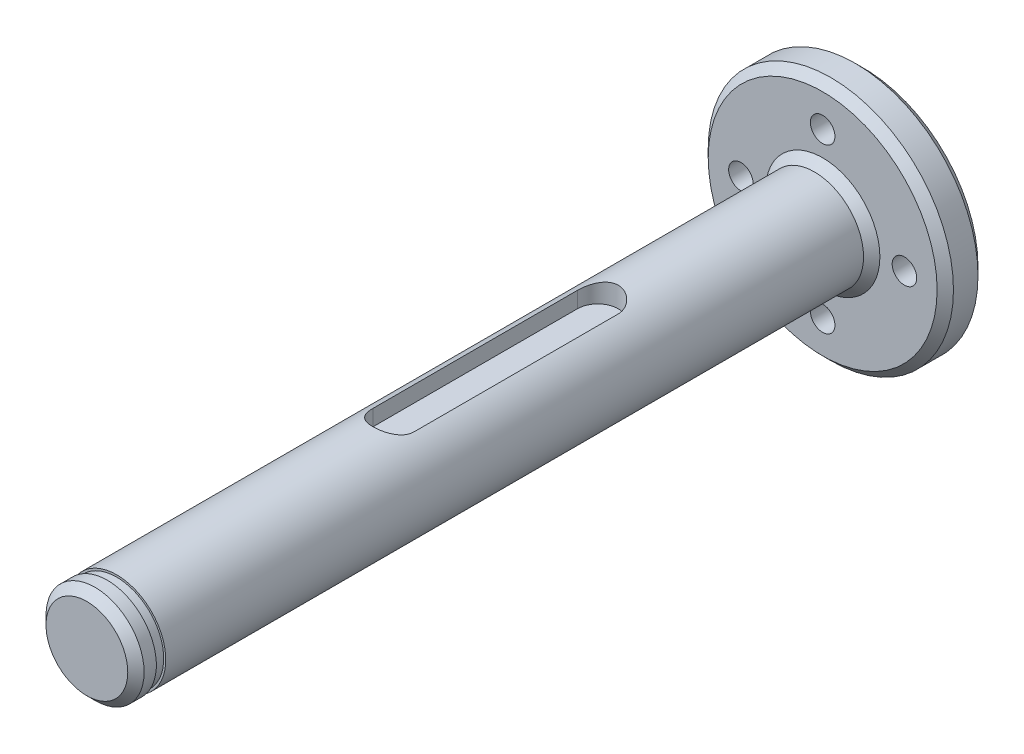
ISO-10303-21;
HEADER;
FILE_DESCRIPTION(('STEP AP214'),'2;1');
FILE_NAME('part.step','',(''),(''),'','','');
FILE_SCHEMA(('AUTOMOTIVE_DESIGN { 1 0 10303 214 1 1 1 1 }'));
ENDSEC;
DATA;
#1=APPLICATION_CONTEXT('core data for automotive mechanical design processes');
#2=APPLICATION_PROTOCOL_DEFINITION('international standard','automotive_design',2000,#1);
#3=PRODUCT_CONTEXT('',#1,'mechanical');
#4=PRODUCT('Part','Part','',(#3));
#5=PRODUCT_RELATED_PRODUCT_CATEGORY('part','',(#4));
#6=PRODUCT_DEFINITION_FORMATION('','',#4);
#7=PRODUCT_DEFINITION_CONTEXT('part definition',#1,'design');
#8=PRODUCT_DEFINITION('design','',#6,#7);
#9=PRODUCT_DEFINITION_SHAPE('','',#8);
#10=(LENGTH_UNIT() NAMED_UNIT(*) SI_UNIT(.MILLI.,.METRE.));
#11=(NAMED_UNIT(*) PLANE_ANGLE_UNIT() SI_UNIT($,.RADIAN.));
#12=(NAMED_UNIT(*) SI_UNIT($,.STERADIAN.) SOLID_ANGLE_UNIT());
#13=UNCERTAINTY_MEASURE_WITH_UNIT(LENGTH_MEASURE(1.E-05),#10,'distance_accuracy_value','');
#14=(GEOMETRIC_REPRESENTATION_CONTEXT(3) GLOBAL_UNCERTAINTY_ASSIGNED_CONTEXT((#13)) GLOBAL_UNIT_ASSIGNED_CONTEXT((#10,
#11,#12)) REPRESENTATION_CONTEXT('',''));
#15=CARTESIAN_POINT('',(0.,0.,0.));
#16=DIRECTION('',(0.,0.,1.));
#17=DIRECTION('',(1.,0.,0.));
#18=AXIS2_PLACEMENT_3D('',#15,#16,#17);
#19=CARTESIAN_POINT('',(0.,0.,95.));
#20=DIRECTION('',(0.,0.,-1.));
#21=DIRECTION('',(-1.,0.,0.));
#22=AXIS2_PLACEMENT_3D('',#19,#20,#21);
#23=CYLINDRICAL_SURFACE('',#22,6.00000000000006);
#24=CARTESIAN_POINT('',(0.,0.,91.35));
#25=DIRECTION('',(0.,0.,-1.));
#26=DIRECTION('',(-1.,0.,0.));
#27=AXIS2_PLACEMENT_3D('',#24,#25,#26);
#28=CIRCLE('',#27,6.00000000000006);
#29=CARTESIAN_POINT('',(-6.00000000000005,0.,91.35));
#30=VERTEX_POINT('',#29);
#31=EDGE_CURVE('E100',#30,#30,#28,.T.);
#32=ORIENTED_EDGE('',*,*,#31,.T.);
#33=EDGE_LOOP('',(#32));
#34=FACE_BOUND('',#33,.T.);
#35=CARTESIAN_POINT('',(0.,0.,6.00000000000009));
#36=DIRECTION('',(0.,0.,1.));
#37=DIRECTION('',(1.,0.,0.));
#38=AXIS2_PLACEMENT_3D('',#35,#36,#37);
#39=CIRCLE('',#38,6.00000000000006);
#40=CARTESIAN_POINT('',(6.00000000000007,0.,6.00000000000009));
#41=VERTEX_POINT('',#40);
#42=EDGE_CURVE('E151',#41,#41,#39,.T.);
#43=ORIENTED_EDGE('',*,*,#42,.T.);
#44=EDGE_LOOP('',(#43));
#45=FACE_BOUND('',#44,.T.);
#46=DIRECTION('',(0.,0.,-1.));
#47=VECTOR('',#46,1.);
#48=CARTESIAN_POINT('',(-2.5,5.45435605731792,95.));
#49=LINE('',#48,#47);
#50=CARTESIAN_POINT('',(-2.5,5.45435605731792,57.5));
#51=VERTEX_POINT('',#50);
#52=CARTESIAN_POINT('',(-2.5,5.45435605731792,32.5));
#53=VERTEX_POINT('',#52);
#54=EDGE_CURVE('E59',#51,#53,#49,.T.);
#55=ORIENTED_EDGE('',*,*,#54,.T.);
#56=CARTESIAN_POINT('',(-2.5,5.45435605731792,32.5));
#57=CARTESIAN_POINT('',(-2.50001024965806,5.45434143672747,32.433009578603));
#58=CARTESIAN_POINT('',(-2.49730766074456,5.45558986423121,32.3660271423929));
#59=CARTESIAN_POINT('',(-2.48655699342007,5.46050344433198,32.232608782394));
#60=CARTESIAN_POINT('',(-2.47851112553775,5.46416759753234,32.1661726441022));
#61=CARTESIAN_POINT('',(-2.45719882557102,5.47378318611773,32.0345981401286));
#62=CARTESIAN_POINT('',(-2.44395446621823,5.47972494833878,31.9694554951153));
#63=CARTESIAN_POINT('',(-2.41239773056354,5.49369035165674,31.8406523494294));
#64=CARTESIAN_POINT('',(-2.39408500729503,5.5017141352809,31.7769919505508));
#65=CARTESIAN_POINT('',(-2.33184505253746,5.52852216859042,31.5890295233108));
#66=CARTESIAN_POINT('',(-2.28056973965756,5.55006534458079,31.4674650590801));
#67=CARTESIAN_POINT('',(-2.16009667726576,5.59805026874347,31.234605030022));
#68=CARTESIAN_POINT('',(-2.09088024017802,5.624497116382,31.1233203375838));
#69=CARTESIAN_POINT('',(-1.93194216605246,5.68111739532856,30.9073444819703));
#70=CARTESIAN_POINT('',(-1.84129131772596,5.71141645652264,30.8033685362414));
#71=CARTESIAN_POINT('',(-1.6440247325164,5.77129106659518,30.6115830630309));
#72=CARTESIAN_POINT('',(-1.53740558511415,5.80086645933838,30.5237769980765));
#73=CARTESIAN_POINT('',(-1.30552662419109,5.85751079611211,30.3631011710238));
#74=CARTESIAN_POINT('',(-1.17965801419141,5.88441492036282,30.2910465122975));
#75=CARTESIAN_POINT('',(-0.916263349803652,5.93113050419028,30.1694476051954));
#76=CARTESIAN_POINT('',(-0.778742558960745,5.95094514533812,30.1198932565872));
#77=CARTESIAN_POINT('',(-0.50353821291176,5.98035028996101,30.0473214289529));
#78=CARTESIAN_POINT('',(-0.366235636683347,5.99041924152304,30.0230570539867));
#79=CARTESIAN_POINT('',(-0.089160885661303,6.00093656296533,29.997724732109));
#80=CARTESIAN_POINT('',(0.050610310785374,6.00138866214759,29.9966477933812));
#81=CARTESIAN_POINT('',(0.319586702683729,5.99290254661364,30.0170686483622));
#82=CARTESIAN_POINT('',(0.448917245472149,5.98453414521303,30.0371965487351));
#83=CARTESIAN_POINT('',(0.702167963543977,5.96013005449452,30.0971069089122));
#84=CARTESIAN_POINT('',(0.826087834150444,5.94409393401062,30.1368904739846));
#85=CARTESIAN_POINT('',(1.06727556823007,5.90559715444495,30.2354557836619));
#86=CARTESIAN_POINT('',(1.18441306332021,5.88304219015538,30.2945181793044));
#87=CARTESIAN_POINT('',(1.40742238732224,5.83371457161599,30.4296907819691));
#88=CARTESIAN_POINT('',(1.51329009151027,5.80694038196903,30.5058071993045));
#89=CARTESIAN_POINT('',(1.71867537807254,5.74963576527158,30.6791590335425));
#90=CARTESIAN_POINT('',(1.81722082953266,5.7189735965302,30.7775041712583));
#91=CARTESIAN_POINT('',(1.99685313522823,5.65876079183108,30.9894106464249));
#92=CARTESIAN_POINT('',(2.07793113494236,5.6292107258498,31.1029796539946));
#93=CARTESIAN_POINT('',(2.22284514508405,5.57361619012475,31.3468546501545));
#94=CARTESIAN_POINT('',(2.28601504206341,5.54772171984221,31.4775928734739));
#95=CARTESIAN_POINT('',(2.38897619183128,5.50417661447937,31.7491453734569));
#96=CARTESIAN_POINT('',(2.4288105117282,5.48651080537522,31.8899405469978));
#97=CARTESIAN_POINT('',(2.47065526537902,5.46773287951063,32.1101508434078));
#98=CARTESIAN_POINT('',(2.48164099212927,5.46274303006071,32.1876310667866));
#99=CARTESIAN_POINT('',(2.49631631258703,5.45604541462654,32.3433901813395));
#100=CARTESIAN_POINT('',(2.50000851178052,5.45433647659984,32.4216687772607));
#101=CARTESIAN_POINT('',(2.5,5.45435605731793,32.5));
#102=B_SPLINE_CURVE_WITH_KNOTS('',3,(#56,#57,#58,#59,#60,#61,#62,#63,#64,#65,#66,#67,#68,#69,
#70,#71,#72,#73,#74,#75,#76,#77,#78,#79,#80,#81,#82,#83,#84,#85,#86,#87,#88,#89,#90,#91,#92,#93,
#94,#95,#96,#97,#98,#99,#100,#101),.UNSPECIFIED.,.F.,.F.,(4,2,2,2,2,2,2,2,2,2,2,2,2,2,2,2,2,2,2,
2,2,2,4),(0.,0.200891876435012,0.401700695097969,0.601665948391959,0.801644894158603,
1.20075599352942,1.6002844916061,2.02212344548655,2.44405262481498,2.88432120276328,
3.32439195134774,3.74155898035477,4.15856423395471,4.55019084443641,4.94183947919072,
5.33946474085078,5.7372350358998,6.16301556467704,6.58901142297275,7.02923147484728,
7.4686364954648,7.70350874445824,7.93829707423865),.UNSPECIFIED.);
#103=CARTESIAN_POINT('',(2.5,5.45435605731793,32.5));
#104=VERTEX_POINT('',#103);
#105=EDGE_CURVE('E172',#53,#104,#102,.T.);
#106=ORIENTED_EDGE('',*,*,#105,.T.);
#107=DIRECTION('',(0.,0.,-1.));
#108=VECTOR('',#107,1.);
#109=CARTESIAN_POINT('',(2.5,5.45435605731793,95.));
#110=LINE('',#109,#108);
#111=CARTESIAN_POINT('',(2.5,5.45435605731793,57.5));
#112=VERTEX_POINT('',#111);
#113=EDGE_CURVE('E473',#104,#112,#110,.F.);
#114=ORIENTED_EDGE('',*,*,#113,.T.);
#115=CARTESIAN_POINT('',(2.5,5.45435605731793,57.5));
#116=CARTESIAN_POINT('',(2.50001024965806,5.45434143672747,57.5669904213969));
#117=CARTESIAN_POINT('',(2.49730766074456,5.45558986423122,57.6339728576071));
#118=CARTESIAN_POINT('',(2.48655699342007,5.46050344433199,57.7673912176059));
#119=CARTESIAN_POINT('',(2.47851112553775,5.46416759753234,57.8338273558978));
#120=CARTESIAN_POINT('',(2.45719882557102,5.47378318611773,57.9654018598714));
#121=CARTESIAN_POINT('',(2.44395446621823,5.47972494833879,58.0305445048846));
#122=CARTESIAN_POINT('',(2.41239773056354,5.49369035165675,58.1593476505706));
#123=CARTESIAN_POINT('',(2.39408500729503,5.50171413528091,58.2230080494491));
#124=CARTESIAN_POINT('',(2.33184505253746,5.52852216859043,58.4109704766891));
#125=CARTESIAN_POINT('',(2.28056973965756,5.5500653445808,58.5325349409199));
#126=CARTESIAN_POINT('',(2.16009667726576,5.59805026874347,58.765394969978));
#127=CARTESIAN_POINT('',(2.09088024017802,5.624497116382,58.8766796624162));
#128=CARTESIAN_POINT('',(1.93194216605246,5.68111739532856,59.0926555180296));
#129=CARTESIAN_POINT('',(1.84129131772596,5.71141645652265,59.1966314637585));
#130=CARTESIAN_POINT('',(1.6440247325164,5.77129106659519,59.388416936969));
#131=CARTESIAN_POINT('',(1.53740558511415,5.80086645933838,59.4762230019235));
#132=CARTESIAN_POINT('',(1.30552662419109,5.85751079611211,59.6368988289761));
#133=CARTESIAN_POINT('',(1.17965801419141,5.88441492036282,59.7089534877025));
#134=CARTESIAN_POINT('',(0.916263349803648,5.93113050419029,59.8305523948045));
#135=CARTESIAN_POINT('',(0.77874255896074,5.95094514533812,59.8801067434128));
#136=CARTESIAN_POINT('',(0.503538212911754,5.98035028996101,59.952678571047));
#137=CARTESIAN_POINT('',(0.366235636683342,5.99041924152304,59.9769429460133));
#138=CARTESIAN_POINT('',(0.0891608856612987,6.00093656296533,60.0022752678909));
#139=CARTESIAN_POINT('',(-0.0506103107853779,6.00138866214759,60.0033522066188));
#140=CARTESIAN_POINT('',(-0.319586702683731,5.99290254661364,59.9829313516378));
#141=CARTESIAN_POINT('',(-0.448917245472149,5.98453414521303,59.9628034512649));
#142=CARTESIAN_POINT('',(-0.702167963543977,5.96013005449452,59.9028930910878));
#143=CARTESIAN_POINT('',(-0.826087834150446,5.94409393401062,59.8631095260153));
#144=CARTESIAN_POINT('',(-1.06727556823008,5.90559715444495,59.7645442163381));
#145=CARTESIAN_POINT('',(-1.18441306332021,5.88304219015537,59.7054818206956));
#146=CARTESIAN_POINT('',(-1.40742238732224,5.83371457161599,59.5703092180309));
#147=CARTESIAN_POINT('',(-1.51329009151027,5.80694038196903,59.4941928006954));
#148=CARTESIAN_POINT('',(-1.71867537807254,5.74963576527158,59.3208409664575));
#149=CARTESIAN_POINT('',(-1.81722082953265,5.7189735965302,59.2224958287417));
#150=CARTESIAN_POINT('',(-1.99685313522823,5.65876079183107,59.0105893535751));
#151=CARTESIAN_POINT('',(-2.07793113494236,5.62921072584979,58.8970203460053));
#152=CARTESIAN_POINT('',(-2.22284514508405,5.57361619012474,58.6531453498455));
#153=CARTESIAN_POINT('',(-2.28601504206342,5.5477217198422,58.522407126526));
#154=CARTESIAN_POINT('',(-2.38897619183129,5.50417661447936,58.2508546265431));
#155=CARTESIAN_POINT('',(-2.42881051172821,5.48651080537521,58.1100594530022));
#156=CARTESIAN_POINT('',(-2.47065526537903,5.46773287951062,57.8898491565922));
#157=CARTESIAN_POINT('',(-2.48164099212927,5.4627430300607,57.8123689332134));
#158=CARTESIAN_POINT('',(-2.49631631258703,5.45604541462654,57.6566098186604));
#159=CARTESIAN_POINT('',(-2.50000851178052,5.45433647659984,57.5783312227393));
#160=CARTESIAN_POINT('',(-2.5,5.45435605731792,57.5));
#161=B_SPLINE_CURVE_WITH_KNOTS('',3,(#115,#116,#117,#118,#119,#120,#121,#122,#123,#124,#125,
#126,#127,#128,#129,#130,#131,#132,#133,#134,#135,#136,#137,#138,#139,#140,#141,#142,#143,#144,
#145,#146,#147,#148,#149,#150,#151,#152,#153,#154,#155,#156,#157,#158,#159,#160),.UNSPECIFIED.,
.F.,.F.,(4,2,2,2,2,2,2,2,2,2,2,2,2,2,2,2,2,2,2,2,2,2,4),(0.,0.200891876435012,0.401700695097969,
0.601665948391966,0.801644894158603,1.20075599352942,1.6002844916061,2.02212344548655,
2.44405262481498,2.88432120276328,3.32439195134775,3.74155898035477,4.15856423395471,
4.55019084443641,4.94183947919072,5.33946474085078,5.73723503589979,6.16301556467704,
6.58901142297275,7.02923147484729,7.4686364954648,7.70350874445824,7.93829707423865),.UNSPECIFIED.);
#162=EDGE_CURVE('E51',#112,#51,#161,.T.);
#163=ORIENTED_EDGE('',*,*,#162,.T.);
#164=EDGE_LOOP('',(#55,#106,#114,#163));
#165=FACE_BOUND('',#164,.T.);
#166=ADVANCED_FACE('F35',(#34,#45,#165),#23,.T.);
#167=CARTESIAN_POINT('',(0.,0.,5.));
#168=DIRECTION('',(0.,0.,-1.));
#169=DIRECTION('',(-1.,0.,0.));
#170=AXIS2_PLACEMENT_3D('',#167,#168,#169);
#171=CYLINDRICAL_SURFACE('',#170,15.);
#172=CARTESIAN_POINT('',(0.,0.,4.));
#173=DIRECTION('',(0.,0.,1.));
#174=DIRECTION('',(1.,0.,0.));
#175=AXIS2_PLACEMENT_3D('',#172,#173,#174);
#176=CIRCLE('',#175,15.);
#177=CARTESIAN_POINT('',(15.,0.,4.));
#178=VERTEX_POINT('',#177);
#179=EDGE_CURVE('E166',#178,#178,#176,.F.);
#180=ORIENTED_EDGE('',*,*,#179,.T.);
#181=EDGE_LOOP('',(#180));
#182=FACE_BOUND('',#181,.T.);
#183=CARTESIAN_POINT('',(0.,0.,0.999999999999982));
#184=DIRECTION('',(0.,0.,1.));
#185=DIRECTION('',(1.,0.,0.));
#186=AXIS2_PLACEMENT_3D('',#183,#184,#185);
#187=CIRCLE('',#186,15.);
#188=CARTESIAN_POINT('',(15.,0.,0.999999999999982));
#189=VERTEX_POINT('',#188);
#190=EDGE_CURVE('E163',#189,#189,#187,.T.);
#191=ORIENTED_EDGE('',*,*,#190,.T.);
#192=EDGE_LOOP('',(#191));
#193=FACE_BOUND('',#192,.T.);
#194=ADVANCED_FACE('F221',(#182,#193),#171,.T.);
#195=CARTESIAN_POINT('',(0.,0.,5.));
#196=DIRECTION('',(0.,0.,1.));
#197=DIRECTION('',(1.,0.,0.));
#198=AXIS2_PLACEMENT_3D('',#195,#196,#197);
#199=PLANE('',#198);
#200=CARTESIAN_POINT('',(0.,0.,5.));
#201=DIRECTION('',(0.,0.,1.));
#202=DIRECTION('',(1.,0.,0.));
#203=AXIS2_PLACEMENT_3D('',#200,#201,#202);
#204=CIRCLE('',#203,7.00000000000015);
#205=CARTESIAN_POINT('',(7.00000000000016,0.,5.));
#206=VERTEX_POINT('',#205);
#207=EDGE_CURVE('E160',#206,#206,#204,.F.);
#208=ORIENTED_EDGE('',*,*,#207,.T.);
#209=EDGE_LOOP('',(#208));
#210=FACE_BOUND('',#209,.T.);
#211=CARTESIAN_POINT('',(0.,0.,5.));
#212=DIRECTION('',(0.,0.,1.));
#213=DIRECTION('',(1.,0.,0.));
#214=AXIS2_PLACEMENT_3D('',#211,#212,#213);
#215=CIRCLE('',#214,14.);
#216=CARTESIAN_POINT('',(14.,0.,5.));
#217=VERTEX_POINT('',#216);
#218=EDGE_CURVE('E157',#217,#217,#215,.T.);
#219=ORIENTED_EDGE('',*,*,#218,.T.);
#220=EDGE_LOOP('',(#219));
#221=FACE_BOUND('',#220,.T.);
#222=CARTESIAN_POINT('',(-10.,0.,5.));
#223=DIRECTION('',(0.,0.,-1.));
#224=DIRECTION('',(-1.,0.,0.));
#225=AXIS2_PLACEMENT_3D('',#222,#223,#224);
#226=CIRCLE('',#225,1.5);
#227=CARTESIAN_POINT('',(-11.5,0.,5.));
#228=VERTEX_POINT('',#227);
#229=EDGE_CURVE('E125',#228,#228,#226,.T.);
#230=ORIENTED_EDGE('',*,*,#229,.T.);
#231=EDGE_LOOP('',(#230));
#232=FACE_BOUND('',#231,.T.);
#233=CARTESIAN_POINT('',(0.,-9.99999999999999,5.));
#234=DIRECTION('',(0.,0.,-1.));
#235=DIRECTION('',(-1.,0.,0.));
#236=AXIS2_PLACEMENT_3D('',#233,#234,#235);
#237=CIRCLE('',#236,1.5);
#238=CARTESIAN_POINT('',(-1.5,-9.99999999999999,5.));
#239=VERTEX_POINT('',#238);
#240=EDGE_CURVE('E132',#239,#239,#237,.T.);
#241=ORIENTED_EDGE('',*,*,#240,.T.);
#242=EDGE_LOOP('',(#241));
#243=FACE_BOUND('',#242,.T.);
#244=CARTESIAN_POINT('',(10.,0.,5.));
#245=DIRECTION('',(0.,0.,-1.));
#246=DIRECTION('',(-1.,0.,0.));
#247=AXIS2_PLACEMENT_3D('',#244,#245,#246);
#248=CIRCLE('',#247,1.5);
#249=CARTESIAN_POINT('',(8.5,0.,5.));
#250=VERTEX_POINT('',#249);
#251=EDGE_CURVE('E138',#250,#250,#248,.T.);
#252=ORIENTED_EDGE('',*,*,#251,.T.);
#253=EDGE_LOOP('',(#252));
#254=FACE_BOUND('',#253,.T.);
#255=CARTESIAN_POINT('',(0.,10.,5.));
#256=DIRECTION('',(0.,0.,-1.));
#257=DIRECTION('',(-1.,0.,0.));
#258=AXIS2_PLACEMENT_3D('',#255,#256,#257);
#259=CIRCLE('',#258,1.5);
#260=CARTESIAN_POINT('',(-1.5,10.,5.));
#261=VERTEX_POINT('',#260);
#262=EDGE_CURVE('E144',#261,#261,#259,.T.);
#263=ORIENTED_EDGE('',*,*,#262,.T.);
#264=EDGE_LOOP('',(#263));
#265=FACE_BOUND('',#264,.T.);
#266=ADVANCED_FACE('F226',(#210,#221,#232,#243,#254,#265),#199,.T.);
#267=CARTESIAN_POINT('',(0.,0.,0.));
#268=DIRECTION('',(0.,0.,1.));
#269=DIRECTION('',(1.,0.,0.));
#270=AXIS2_PLACEMENT_3D('',#267,#268,#269);
#271=PLANE('',#270);
#272=CARTESIAN_POINT('',(0.,0.,0.));
#273=DIRECTION('',(0.,0.,1.));
#274=DIRECTION('',(1.,0.,0.));
#275=AXIS2_PLACEMENT_3D('',#272,#273,#274);
#276=CIRCLE('',#275,3.50000000000002);
#277=CARTESIAN_POINT('',(3.50000000000002,0.,0.));
#278=VERTEX_POINT('',#277);
#279=EDGE_CURVE('E11',#278,#278,#276,.T.);
#280=ORIENTED_EDGE('',*,*,#279,.T.);
#281=EDGE_LOOP('',(#280));
#282=FACE_BOUND('',#281,.T.);
#283=CARTESIAN_POINT('',(0.,0.,0.));
#284=DIRECTION('',(0.,0.,1.));
#285=DIRECTION('',(1.,0.,0.));
#286=AXIS2_PLACEMENT_3D('',#283,#284,#285);
#287=CIRCLE('',#286,14.);
#288=CARTESIAN_POINT('',(14.,0.,0.));
#289=VERTEX_POINT('',#288);
#290=EDGE_CURVE('E169',#289,#289,#287,.F.);
#291=ORIENTED_EDGE('',*,*,#290,.T.);
#292=EDGE_LOOP('',(#291));
#293=FACE_BOUND('',#292,.T.);
#294=CARTESIAN_POINT('',(-10.,0.,0.));
#295=DIRECTION('',(0.,0.,-1.));
#296=DIRECTION('',(-1.,0.,0.));
#297=AXIS2_PLACEMENT_3D('',#294,#295,#296);
#298=CIRCLE('',#297,1.5);
#299=CARTESIAN_POINT('',(-11.5,0.,0.));
#300=VERTEX_POINT('',#299);
#301=EDGE_CURVE('E129',#300,#300,#298,.T.);
#302=ORIENTED_EDGE('',*,*,#301,.F.);
#303=EDGE_LOOP('',(#302));
#304=FACE_BOUND('',#303,.T.);
#305=CARTESIAN_POINT('',(0.,-9.99999999999999,0.));
#306=DIRECTION('',(0.,0.,-1.));
#307=DIRECTION('',(-1.,0.,0.));
#308=AXIS2_PLACEMENT_3D('',#305,#306,#307);
#309=CIRCLE('',#308,1.5);
#310=CARTESIAN_POINT('',(-1.5,-9.99999999999999,0.));
#311=VERTEX_POINT('',#310);
#312=EDGE_CURVE('E135',#311,#311,#309,.T.);
#313=ORIENTED_EDGE('',*,*,#312,.F.);
#314=EDGE_LOOP('',(#313));
#315=FACE_BOUND('',#314,.T.);
#316=CARTESIAN_POINT('',(10.,0.,0.));
#317=DIRECTION('',(0.,0.,-1.));
#318=DIRECTION('',(-1.,0.,0.));
#319=AXIS2_PLACEMENT_3D('',#316,#317,#318);
#320=CIRCLE('',#319,1.5);
#321=CARTESIAN_POINT('',(8.5,0.,0.));
#322=VERTEX_POINT('',#321);
#323=EDGE_CURVE('E141',#322,#322,#320,.T.);
#324=ORIENTED_EDGE('',*,*,#323,.F.);
#325=EDGE_LOOP('',(#324));
#326=FACE_BOUND('',#325,.T.);
#327=CARTESIAN_POINT('',(0.,10.,0.));
#328=DIRECTION('',(0.,0.,-1.));
#329=DIRECTION('',(-1.,0.,0.));
#330=AXIS2_PLACEMENT_3D('',#327,#328,#329);
#331=CIRCLE('',#330,1.5);
#332=CARTESIAN_POINT('',(-1.5,10.,0.));
#333=VERTEX_POINT('',#332);
#334=EDGE_CURVE('E118',#333,#333,#331,.T.);
#335=ORIENTED_EDGE('',*,*,#334,.F.);
#336=EDGE_LOOP('',(#335));
#337=FACE_BOUND('',#336,.T.);
#338=ADVANCED_FACE('F392',(#282,#293,#304,#315,#326,#337),#271,.F.);
#339=CARTESIAN_POINT('',(0.,10.,5.));
#340=DIRECTION('',(0.,0.,-1.));
#341=DIRECTION('',(-1.,0.,0.));
#342=AXIS2_PLACEMENT_3D('',#339,#340,#341);
#343=CYLINDRICAL_SURFACE('',#342,1.5);
#344=ORIENTED_EDGE('',*,*,#262,.F.);
#345=EDGE_LOOP('',(#344));
#346=FACE_BOUND('',#345,.T.);
#347=ORIENTED_EDGE('',*,*,#334,.T.);
#348=EDGE_LOOP('',(#347));
#349=FACE_BOUND('',#348,.T.);
#350=ADVANCED_FACE('F383',(#346,#349),#343,.F.);
#351=CARTESIAN_POINT('',(10.,0.,5.));
#352=DIRECTION('',(0.,0.,-1.));
#353=DIRECTION('',(-1.,0.,0.));
#354=AXIS2_PLACEMENT_3D('',#351,#352,#353);
#355=CYLINDRICAL_SURFACE('',#354,1.5);
#356=ORIENTED_EDGE('',*,*,#251,.F.);
#357=EDGE_LOOP('',(#356));
#358=FACE_BOUND('',#357,.T.);
#359=ORIENTED_EDGE('',*,*,#323,.T.);
#360=EDGE_LOOP('',(#359));
#361=FACE_BOUND('',#360,.T.);
#362=ADVANCED_FACE('F374',(#358,#361),#355,.F.);
#363=CARTESIAN_POINT('',(0.,-9.99999999999999,5.));
#364=DIRECTION('',(0.,0.,-1.));
#365=DIRECTION('',(-1.,0.,0.));
#366=AXIS2_PLACEMENT_3D('',#363,#364,#365);
#367=CYLINDRICAL_SURFACE('',#366,1.5);
#368=ORIENTED_EDGE('',*,*,#240,.F.);
#369=EDGE_LOOP('',(#368));
#370=FACE_BOUND('',#369,.T.);
#371=ORIENTED_EDGE('',*,*,#312,.T.);
#372=EDGE_LOOP('',(#371));
#373=FACE_BOUND('',#372,.T.);
#374=ADVANCED_FACE('F365',(#370,#373),#367,.F.);
#375=CARTESIAN_POINT('',(-10.,0.,5.));
#376=DIRECTION('',(0.,0.,-1.));
#377=DIRECTION('',(-1.,0.,0.));
#378=AXIS2_PLACEMENT_3D('',#375,#376,#377);
#379=CYLINDRICAL_SURFACE('',#378,1.5);
#380=ORIENTED_EDGE('',*,*,#229,.F.);
#381=EDGE_LOOP('',(#380));
#382=FACE_BOUND('',#381,.T.);
#383=ORIENTED_EDGE('',*,*,#301,.T.);
#384=EDGE_LOOP('',(#383));
#385=FACE_BOUND('',#384,.T.);
#386=ADVANCED_FACE('F345',(#382,#385),#379,.F.);
#387=CARTESIAN_POINT('',(0.,0.,6.00000000000009));
#388=DIRECTION('',(0.,0.,-1.));
#389=DIRECTION('',(-1.,0.,0.));
#390=AXIS2_PLACEMENT_3D('',#387,#388,#389);
#391=CONICAL_SURFACE('',#390,6.00000000000006,0.785398163397447);
#392=ORIENTED_EDGE('',*,*,#207,.F.);
#393=EDGE_LOOP('',(#392));
#394=FACE_BOUND('',#393,.T.);
#395=ORIENTED_EDGE('',*,*,#42,.F.);
#396=EDGE_LOOP('',(#395));
#397=FACE_BOUND('',#396,.T.);
#398=ADVANCED_FACE('F336',(#394,#397),#391,.T.);
#399=CARTESIAN_POINT('',(0.,0.,5.));
#400=DIRECTION('',(0.,0.,-1.));
#401=DIRECTION('',(-1.,0.,0.));
#402=AXIS2_PLACEMENT_3D('',#399,#400,#401);
#403=CONICAL_SURFACE('',#402,14.,0.785398163397444);
#404=ORIENTED_EDGE('',*,*,#179,.F.);
#405=EDGE_LOOP('',(#404));
#406=FACE_BOUND('',#405,.T.);
#407=ORIENTED_EDGE('',*,*,#218,.F.);
#408=EDGE_LOOP('',(#407));
#409=FACE_BOUND('',#408,.T.);
#410=ADVANCED_FACE('F328',(#406,#409),#403,.T.);
#411=CARTESIAN_POINT('',(0.,0.,0.999999999999982));
#412=DIRECTION('',(0.,0.,1.));
#413=DIRECTION('',(1.,0.,0.));
#414=AXIS2_PLACEMENT_3D('',#411,#412,#413);
#415=CONICAL_SURFACE('',#414,15.,0.785398163397453);
#416=ORIENTED_EDGE('',*,*,#290,.F.);
#417=EDGE_LOOP('',(#416));
#418=FACE_BOUND('',#417,.T.);
#419=ORIENTED_EDGE('',*,*,#190,.F.);
#420=EDGE_LOOP('',(#419));
#421=FACE_BOUND('',#420,.T.);
#422=ADVANCED_FACE('F205',(#418,#421),#415,.T.);
#423=CARTESIAN_POINT('',(0.,3.50000000000006,57.5));
#424=DIRECTION('',(0.,1.,0.));
#425=DIRECTION('',(0.,0.,1.));
#426=AXIS2_PLACEMENT_3D('',#423,#424,#425);
#427=CYLINDRICAL_SURFACE('',#426,2.5);
#428=DIRECTION('',(0.,1.,0.));
#429=VECTOR('',#428,1.);
#430=CARTESIAN_POINT('',(2.5,3.50000000000006,57.5));
#431=LINE('',#430,#429);
#432=CARTESIAN_POINT('',(2.5,3.50000000000006,57.5));
#433=VERTEX_POINT('',#432);
#434=EDGE_CURVE('E115',#433,#112,#431,.T.);
#435=ORIENTED_EDGE('',*,*,#434,.F.);
#436=CARTESIAN_POINT('',(0.,3.50000000000006,57.5));
#437=DIRECTION('',(0.,1.,0.));
#438=DIRECTION('',(0.,0.,1.));
#439=AXIS2_PLACEMENT_3D('',#436,#437,#438);
#440=CIRCLE('',#439,2.5);
#441=CARTESIAN_POINT('',(-2.5,3.50000000000006,57.5));
#442=VERTEX_POINT('',#441);
#443=EDGE_CURVE('E103',#442,#433,#440,.T.);
#444=ORIENTED_EDGE('',*,*,#443,.F.);
#445=DIRECTION('',(0.,1.,0.));
#446=VECTOR('',#445,1.);
#447=CARTESIAN_POINT('',(-2.5,3.50000000000006,57.5));
#448=LINE('',#447,#446);
#449=EDGE_CURVE('E116',#442,#51,#448,.T.);
#450=ORIENTED_EDGE('',*,*,#449,.T.);
#451=ORIENTED_EDGE('',*,*,#162,.F.);
#452=EDGE_LOOP('',(#435,#444,#450,#451));
#453=FACE_BOUND('',#452,.T.);
#454=ADVANCED_FACE('F202',(#453),#427,.F.);
#455=CARTESIAN_POINT('',(-2.5,3.50000000000006,57.5));
#456=DIRECTION('',(-1.,0.,0.));
#457=DIRECTION('',(0.,0.,1.));
#458=AXIS2_PLACEMENT_3D('',#455,#456,#457);
#459=PLANE('',#458);
#460=ORIENTED_EDGE('',*,*,#449,.F.);
#461=DIRECTION('',(0.,0.,1.));
#462=VECTOR('',#461,1.);
#463=CARTESIAN_POINT('',(-2.5,3.50000000000006,57.5));
#464=LINE('',#463,#462);
#465=CARTESIAN_POINT('',(-2.5,3.50000000000006,32.5));
#466=VERTEX_POINT('',#465);
#467=EDGE_CURVE('E112',#466,#442,#464,.T.);
#468=ORIENTED_EDGE('',*,*,#467,.F.);
#469=DIRECTION('',(0.,1.,0.));
#470=VECTOR('',#469,1.);
#471=CARTESIAN_POINT('',(-2.5,3.50000000000006,32.5));
#472=LINE('',#471,#470);
#473=EDGE_CURVE('E119',#466,#53,#472,.T.);
#474=ORIENTED_EDGE('',*,*,#473,.T.);
#475=ORIENTED_EDGE('',*,*,#54,.F.);
#476=EDGE_LOOP('',(#460,#468,#474,#475));
#477=FACE_BOUND('',#476,.T.);
#478=ADVANCED_FACE('F196',(#477),#459,.F.);
#479=CARTESIAN_POINT('',(0.,3.50000000000006,32.5));
#480=DIRECTION('',(0.,1.,0.));
#481=DIRECTION('',(0.,0.,1.));
#482=AXIS2_PLACEMENT_3D('',#479,#480,#481);
#483=CYLINDRICAL_SURFACE('',#482,2.5);
#484=ORIENTED_EDGE('',*,*,#473,.F.);
#485=CARTESIAN_POINT('',(0.,3.50000000000006,32.5));
#486=DIRECTION('',(0.,1.,0.));
#487=DIRECTION('',(0.,0.,1.));
#488=AXIS2_PLACEMENT_3D('',#485,#486,#487);
#489=CIRCLE('',#488,2.5);
#490=CARTESIAN_POINT('',(2.5,3.50000000000006,32.5));
#491=VERTEX_POINT('',#490);
#492=EDGE_CURVE('E109',#491,#466,#489,.T.);
#493=ORIENTED_EDGE('',*,*,#492,.F.);
#494=DIRECTION('',(0.,1.,0.));
#495=VECTOR('',#494,1.);
#496=CARTESIAN_POINT('',(2.5,3.50000000000006,32.5));
#497=LINE('',#496,#495);
#498=EDGE_CURVE('E121',#491,#104,#497,.T.);
#499=ORIENTED_EDGE('',*,*,#498,.T.);
#500=ORIENTED_EDGE('',*,*,#105,.F.);
#501=EDGE_LOOP('',(#484,#493,#499,#500));
#502=FACE_BOUND('',#501,.T.);
#503=ADVANCED_FACE('F190',(#502),#483,.F.);
#504=CARTESIAN_POINT('',(2.5,3.50000000000006,57.5));
#505=DIRECTION('',(1.,0.,0.));
#506=DIRECTION('',(0.,0.,-1.));
#507=AXIS2_PLACEMENT_3D('',#504,#505,#506);
#508=PLANE('',#507);
#509=ORIENTED_EDGE('',*,*,#498,.F.);
#510=DIRECTION('',(0.,0.,-1.));
#511=VECTOR('',#510,1.);
#512=CARTESIAN_POINT('',(2.5,3.50000000000006,57.5));
#513=LINE('',#512,#511);
#514=EDGE_CURVE('E106',#433,#491,#513,.T.);
#515=ORIENTED_EDGE('',*,*,#514,.F.);
#516=ORIENTED_EDGE('',*,*,#434,.T.);
#517=ORIENTED_EDGE('',*,*,#113,.F.);
#518=EDGE_LOOP('',(#509,#515,#516,#517));
#519=FACE_BOUND('',#518,.T.);
#520=ADVANCED_FACE('F195',(#519),#508,.F.);
#521=CARTESIAN_POINT('',(0.,3.50000000000006,57.5));
#522=DIRECTION('',(0.,1.,0.));
#523=DIRECTION('',(0.,0.,1.));
#524=AXIS2_PLACEMENT_3D('',#521,#522,#523);
#525=PLANE('',#524);
#526=ORIENTED_EDGE('',*,*,#443,.T.);
#527=ORIENTED_EDGE('',*,*,#514,.T.);
#528=ORIENTED_EDGE('',*,*,#492,.T.);
#529=ORIENTED_EDGE('',*,*,#467,.T.);
#530=EDGE_LOOP('',(#526,#527,#528,#529));
#531=FACE_BOUND('',#530,.T.);
#532=ADVANCED_FACE('F200',(#531),#525,.T.);
#533=CARTESIAN_POINT('',(-6.00000000000005,0.,91.35));
#534=DIRECTION('',(0.,0.,-1.));
#535=DIRECTION('',(-1.,0.,0.));
#536=AXIS2_PLACEMENT_3D('',#533,#534,#535);
#537=PLANE('',#536);
#538=ORIENTED_EDGE('',*,*,#31,.F.);
#539=EDGE_LOOP('',(#538));
#540=FACE_BOUND('',#539,.T.);
#541=CARTESIAN_POINT('',(0.,0.,91.35));
#542=DIRECTION('',(0.,0.,-1.));
#543=DIRECTION('',(-1.,0.,0.));
#544=AXIS2_PLACEMENT_3D('',#541,#542,#543);
#545=CIRCLE('',#544,5.75);
#546=CARTESIAN_POINT('',(-5.74999999999999,0.,91.35));
#547=VERTEX_POINT('',#546);
#548=EDGE_CURVE('E97',#547,#547,#545,.T.);
#549=ORIENTED_EDGE('',*,*,#548,.T.);
#550=EDGE_LOOP('',(#549));
#551=FACE_BOUND('',#550,.T.);
#552=ADVANCED_FACE('F279',(#540,#551),#537,.F.);
#553=CARTESIAN_POINT('',(0.,0.,0.));
#554=DIRECTION('',(0.,0.,-1.));
#555=DIRECTION('',(-1.,0.,0.));
#556=AXIS2_PLACEMENT_3D('',#553,#554,#555);
#557=CYLINDRICAL_SURFACE('',#556,5.75);
#558=ORIENTED_EDGE('',*,*,#548,.F.);
#559=EDGE_LOOP('',(#558));
#560=FACE_BOUND('',#559,.T.);
#561=CARTESIAN_POINT('',(0.,0.,92.5));
#562=DIRECTION('',(0.,0.,-1.));
#563=DIRECTION('',(-1.,0.,0.));
#564=AXIS2_PLACEMENT_3D('',#561,#562,#563);
#565=CIRCLE('',#564,5.75);
#566=CARTESIAN_POINT('',(-5.74999999999999,0.,92.5));
#567=VERTEX_POINT('',#566);
#568=EDGE_CURVE('E92',#567,#567,#565,.T.);
#569=ORIENTED_EDGE('',*,*,#568,.T.);
#570=EDGE_LOOP('',(#569));
#571=FACE_BOUND('',#570,.T.);
#572=ADVANCED_FACE('F217',(#560,#571),#557,.T.);
#573=CARTESIAN_POINT('',(-6.00000000000005,0.,92.5));
#574=DIRECTION('',(0.,0.,1.));
#575=DIRECTION('',(1.,0.,0.));
#576=AXIS2_PLACEMENT_3D('',#573,#574,#575);
#577=PLANE('',#576);
#578=ORIENTED_EDGE('',*,*,#568,.F.);
#579=EDGE_LOOP('',(#578));
#580=FACE_BOUND('',#579,.T.);
#581=CARTESIAN_POINT('',(0.,0.,92.5));
#582=DIRECTION('',(0.,0.,-1.));
#583=DIRECTION('',(-1.,0.,0.));
#584=AXIS2_PLACEMENT_3D('',#581,#582,#583);
#585=CIRCLE('',#584,6.00000000000006);
#586=CARTESIAN_POINT('',(-6.00000000000005,0.,92.5));
#587=VERTEX_POINT('',#586);
#588=EDGE_CURVE('E89',#587,#587,#585,.T.);
#589=ORIENTED_EDGE('',*,*,#588,.T.);
#590=EDGE_LOOP('',(#589));
#591=FACE_BOUND('',#590,.T.);
#592=ADVANCED_FACE('F209',(#580,#591),#577,.F.);
#593=CARTESIAN_POINT('',(0.,0.,95.));
#594=DIRECTION('',(0.,0.,1.));
#595=DIRECTION('',(1.,0.,0.));
#596=AXIS2_PLACEMENT_3D('',#593,#594,#595);
#597=PLANE('',#596);
#598=CARTESIAN_POINT('',(0.,0.,95.));
#599=DIRECTION('',(0.,0.,1.));
#600=DIRECTION('',(1.,0.,0.));
#601=AXIS2_PLACEMENT_3D('',#598,#599,#600);
#602=CIRCLE('',#601,5.00000000000013);
#603=CARTESIAN_POINT('',(5.00000000000014,0.,95.));
#604=VERTEX_POINT('',#603);
#605=EDGE_CURVE('E128',#604,#604,#602,.T.);
#606=ORIENTED_EDGE('',*,*,#605,.T.);
#607=EDGE_LOOP('',(#606));
#608=FACE_BOUND('',#607,.T.);
#609=ADVANCED_FACE('F206',(#608),#597,.T.);
#610=CARTESIAN_POINT('',(0.,0.,95.));
#611=DIRECTION('',(0.,0.,-1.));
#612=DIRECTION('',(-1.,0.,0.));
#613=AXIS2_PLACEMENT_3D('',#610,#611,#612);
#614=CONICAL_SURFACE('',#613,5.00000000000013,0.785398163397437);
#615=CARTESIAN_POINT('',(0.,0.,94.));
#616=DIRECTION('',(0.,0.,1.));
#617=DIRECTION('',(1.,0.,0.));
#618=AXIS2_PLACEMENT_3D('',#615,#616,#617);
#619=CIRCLE('',#618,6.00000000000006);
#620=CARTESIAN_POINT('',(6.00000000000007,0.,94.));
#621=VERTEX_POINT('',#620);
#622=EDGE_CURVE('E154',#621,#621,#619,.F.);
#623=ORIENTED_EDGE('',*,*,#622,.F.);
#624=EDGE_LOOP('',(#623));
#625=FACE_BOUND('',#624,.T.);
#626=ORIENTED_EDGE('',*,*,#605,.F.);
#627=EDGE_LOOP('',(#626));
#628=FACE_BOUND('',#627,.T.);
#629=ADVANCED_FACE('F208',(#625,#628),#614,.T.);
#630=ORIENTED_EDGE('',*,*,#588,.F.);
#631=EDGE_LOOP('',(#630));
#632=FACE_BOUND('',#631,.T.);
#633=ORIENTED_EDGE('',*,*,#622,.T.);
#634=EDGE_LOOP('',(#633));
#635=FACE_BOUND('',#634,.T.);
#636=ADVANCED_FACE('F83',(#632,#635),#23,.T.);
#637=CARTESIAN_POINT('',(0.,0.,7.5));
#638=DIRECTION('',(0.,0.,-1.));
#639=DIRECTION('',(-1.,0.,0.));
#640=AXIS2_PLACEMENT_3D('',#637,#638,#639);
#641=CONICAL_SURFACE('',#640,2.5,1.02974425867665);
#642=CARTESIAN_POINT('',(0.,0.,9.0021515475689));
#643=VERTEX_POINT('',#642);
#644=VERTEX_LOOP('',#643);
#645=FACE_BOUND('',#644,.T.);
#646=CARTESIAN_POINT('',(0.,0.,7.5));
#647=DIRECTION('',(0.,0.,-1.));
#648=DIRECTION('',(-1.,0.,0.));
#649=AXIS2_PLACEMENT_3D('',#646,#647,#648);
#650=CIRCLE('',#649,2.5);
#651=CARTESIAN_POINT('',(-2.5,0.,7.5));
#652=VERTEX_POINT('',#651);
#653=EDGE_CURVE('E87',#652,#652,#650,.T.);
#654=ORIENTED_EDGE('',*,*,#653,.T.);
#655=EDGE_LOOP('',(#654));
#656=FACE_BOUND('',#655,.T.);
#657=ADVANCED_FACE('F79',(#645,#656),#641,.F.);
#658=CARTESIAN_POINT('',(0.,0.,0.));
#659=DIRECTION('',(0.,0.,-1.));
#660=DIRECTION('',(-1.,0.,0.));
#661=AXIS2_PLACEMENT_3D('',#658,#659,#660);
#662=CYLINDRICAL_SURFACE('',#661,2.5);
#663=CARTESIAN_POINT('',(0.,0.,1.00000000000001));
#664=DIRECTION('',(0.,0.,1.));
#665=DIRECTION('',(1.,0.,0.));
#666=AXIS2_PLACEMENT_3D('',#663,#664,#665);
#667=CIRCLE('',#666,2.5);
#668=CARTESIAN_POINT('',(2.5,0.,1.00000000000001));
#669=VERTEX_POINT('',#668);
#670=EDGE_CURVE('E44',#669,#669,#667,.F.);
#671=ORIENTED_EDGE('',*,*,#670,.T.);
#672=EDGE_LOOP('',(#671));
#673=FACE_BOUND('',#672,.T.);
#674=ORIENTED_EDGE('',*,*,#653,.F.);
#675=EDGE_LOOP('',(#674));
#676=FACE_BOUND('',#675,.T.);
#677=ADVANCED_FACE('F82',(#673,#676),#662,.F.);
#678=CARTESIAN_POINT('',(0.,0.,1.00000000000001));
#679=DIRECTION('',(0.,0.,-1.));
#680=DIRECTION('',(-1.,0.,0.));
#681=AXIS2_PLACEMENT_3D('',#678,#679,#680);
#682=CONICAL_SURFACE('',#681,2.5,0.785398163397451);
#683=ORIENTED_EDGE('',*,*,#279,.F.);
#684=EDGE_LOOP('',(#683));
#685=FACE_BOUND('',#684,.T.);
#686=ORIENTED_EDGE('',*,*,#670,.F.);
#687=EDGE_LOOP('',(#686));
#688=FACE_BOUND('',#687,.T.);
#689=ADVANCED_FACE('F38',(#685,#688),#682,.F.);
#690=CLOSED_SHELL('',(#166,#194,#266,#338,#350,#362,#374,#386,#398,#410,#422,#454,#478,#503,
#520,#532,#552,#572,#592,#609,#629,#636,#657,#677,#689));
#691=MANIFOLD_SOLID_BREP('B2',#690);
#692=ADVANCED_BREP_SHAPE_REPRESENTATION('',(#18,#691),#14);
#693=SHAPE_DEFINITION_REPRESENTATION(#9,#692);
ENDSEC;
END-ISO-10303-21;
